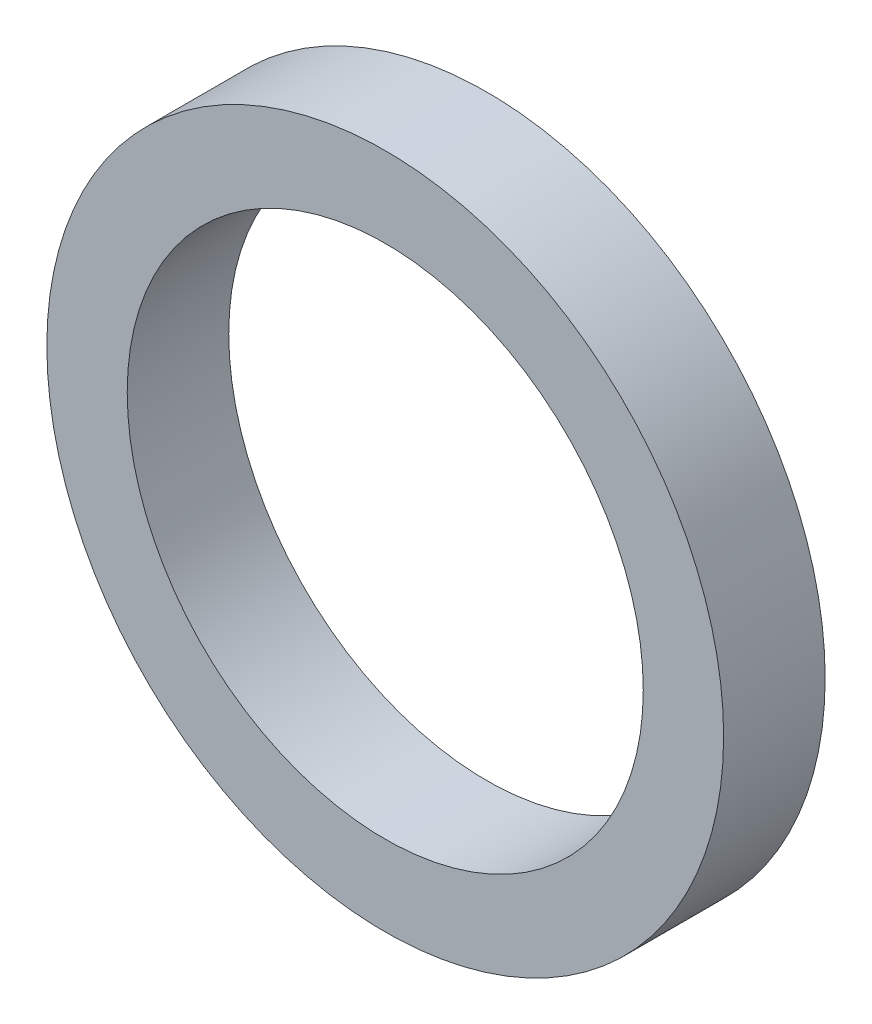
ISO-10303-21;
HEADER;
FILE_DESCRIPTION(('STEP AP214'),'2;1');
FILE_NAME('part.step','',(''),(''),'','','');
FILE_SCHEMA(('AUTOMOTIVE_DESIGN { 1 0 10303 214 1 1 1 1 }'));
ENDSEC;
DATA;
#1=APPLICATION_CONTEXT('core data for automotive mechanical design processes');
#2=APPLICATION_PROTOCOL_DEFINITION('international standard','automotive_design',2000,#1);
#3=PRODUCT_CONTEXT('',#1,'mechanical');
#4=PRODUCT('Part','Part','',(#3));
#5=PRODUCT_RELATED_PRODUCT_CATEGORY('part','',(#4));
#6=PRODUCT_DEFINITION_FORMATION('','',#4);
#7=PRODUCT_DEFINITION_CONTEXT('part definition',#1,'design');
#8=PRODUCT_DEFINITION('design','',#6,#7);
#9=PRODUCT_DEFINITION_SHAPE('','',#8);
#10=(LENGTH_UNIT() NAMED_UNIT(*) SI_UNIT(.MILLI.,.METRE.));
#11=(NAMED_UNIT(*) PLANE_ANGLE_UNIT() SI_UNIT($,.RADIAN.));
#12=(NAMED_UNIT(*) SI_UNIT($,.STERADIAN.) SOLID_ANGLE_UNIT());
#13=UNCERTAINTY_MEASURE_WITH_UNIT(LENGTH_MEASURE(1.E-05),#10,'distance_accuracy_value','');
#14=(GEOMETRIC_REPRESENTATION_CONTEXT(3) GLOBAL_UNCERTAINTY_ASSIGNED_CONTEXT((#13)) GLOBAL_UNIT_ASSIGNED_CONTEXT((#10,
#11,#12)) REPRESENTATION_CONTEXT('',''));
#15=CARTESIAN_POINT('',(0.,0.,0.));
#16=DIRECTION('',(0.,0.,1.));
#17=DIRECTION('',(1.,0.,0.));
#18=AXIS2_PLACEMENT_3D('',#15,#16,#17);
#19=CARTESIAN_POINT('',(0.,0.,6.));
#20=DIRECTION('',(0.,0.,-1.));
#21=DIRECTION('',(-1.,0.,0.));
#22=AXIS2_PLACEMENT_3D('',#19,#20,#21);
#23=CYLINDRICAL_SURFACE('',#22,20.);
#24=CARTESIAN_POINT('',(0.,0.,6.));
#25=DIRECTION('',(0.,0.,1.));
#26=DIRECTION('',(1.,0.,0.));
#27=AXIS2_PLACEMENT_3D('',#24,#25,#26);
#28=CIRCLE('',#27,20.);
#29=CARTESIAN_POINT('',(20.,0.,6.));
#30=VERTEX_POINT('',#29);
#31=EDGE_CURVE('E10',#30,#30,#28,.T.);
#32=ORIENTED_EDGE('',*,*,#31,.F.);
#33=EDGE_LOOP('',(#32));
#34=FACE_BOUND('',#33,.T.);
#35=CARTESIAN_POINT('',(0.,0.,0.));
#36=DIRECTION('',(0.,0.,1.));
#37=DIRECTION('',(1.,0.,0.));
#38=AXIS2_PLACEMENT_3D('',#35,#36,#37);
#39=CIRCLE('',#38,20.);
#40=CARTESIAN_POINT('',(20.,0.,0.));
#41=VERTEX_POINT('',#40);
#42=EDGE_CURVE('E33',#41,#41,#39,.T.);
#43=ORIENTED_EDGE('',*,*,#42,.T.);
#44=EDGE_LOOP('',(#43));
#45=FACE_BOUND('',#44,.T.);
#46=ADVANCED_FACE('F30',(#34,#45),#23,.T.);
#47=CARTESIAN_POINT('',(0.,0.,6.));
#48=DIRECTION('',(0.,0.,1.));
#49=DIRECTION('',(1.,0.,0.));
#50=AXIS2_PLACEMENT_3D('',#47,#48,#49);
#51=PLANE('',#50);
#52=CARTESIAN_POINT('',(0.,0.,6.));
#53=DIRECTION('',(0.,0.,-1.));
#54=DIRECTION('',(-1.,0.,0.));
#55=AXIS2_PLACEMENT_3D('',#52,#53,#54);
#56=CIRCLE('',#55,15.25);
#57=CARTESIAN_POINT('',(-15.25,0.,6.));
#58=VERTEX_POINT('',#57);
#59=EDGE_CURVE('E40',#58,#58,#56,.T.);
#60=ORIENTED_EDGE('',*,*,#59,.T.);
#61=EDGE_LOOP('',(#60));
#62=FACE_BOUND('',#61,.T.);
#63=ORIENTED_EDGE('',*,*,#31,.T.);
#64=EDGE_LOOP('',(#63));
#65=FACE_BOUND('',#64,.T.);
#66=ADVANCED_FACE('F48',(#62,#65),#51,.T.);
#67=CARTESIAN_POINT('',(0.,0.,0.));
#68=DIRECTION('',(0.,0.,1.));
#69=DIRECTION('',(1.,0.,0.));
#70=AXIS2_PLACEMENT_3D('',#67,#68,#69);
#71=PLANE('',#70);
#72=CARTESIAN_POINT('',(0.,0.,0.));
#73=DIRECTION('',(0.,0.,-1.));
#74=DIRECTION('',(-1.,0.,0.));
#75=AXIS2_PLACEMENT_3D('',#72,#73,#74);
#76=CIRCLE('',#75,15.25);
#77=CARTESIAN_POINT('',(-15.25,0.,0.));
#78=VERTEX_POINT('',#77);
#79=EDGE_CURVE('E42',#78,#78,#76,.T.);
#80=ORIENTED_EDGE('',*,*,#79,.F.);
#81=EDGE_LOOP('',(#80));
#82=FACE_BOUND('',#81,.T.);
#83=ORIENTED_EDGE('',*,*,#42,.F.);
#84=EDGE_LOOP('',(#83));
#85=FACE_BOUND('',#84,.T.);
#86=ADVANCED_FACE('F53',(#82,#85),#71,.F.);
#87=CARTESIAN_POINT('',(0.,0.,6.));
#88=DIRECTION('',(0.,0.,-1.));
#89=DIRECTION('',(-1.,0.,0.));
#90=AXIS2_PLACEMENT_3D('',#87,#88,#89);
#91=CYLINDRICAL_SURFACE('',#90,15.25);
#92=ORIENTED_EDGE('',*,*,#59,.F.);
#93=EDGE_LOOP('',(#92));
#94=FACE_BOUND('',#93,.T.);
#95=ORIENTED_EDGE('',*,*,#79,.T.);
#96=EDGE_LOOP('',(#95));
#97=FACE_BOUND('',#96,.T.);
#98=ADVANCED_FACE('F50',(#94,#97),#91,.F.);
#99=CLOSED_SHELL('',(#46,#66,#86,#98));
#100=MANIFOLD_SOLID_BREP('B2',#99);
#101=ADVANCED_BREP_SHAPE_REPRESENTATION('',(#18,#100),#14);
#102=SHAPE_DEFINITION_REPRESENTATION(#9,#101);
ENDSEC;
END-ISO-10303-21;
